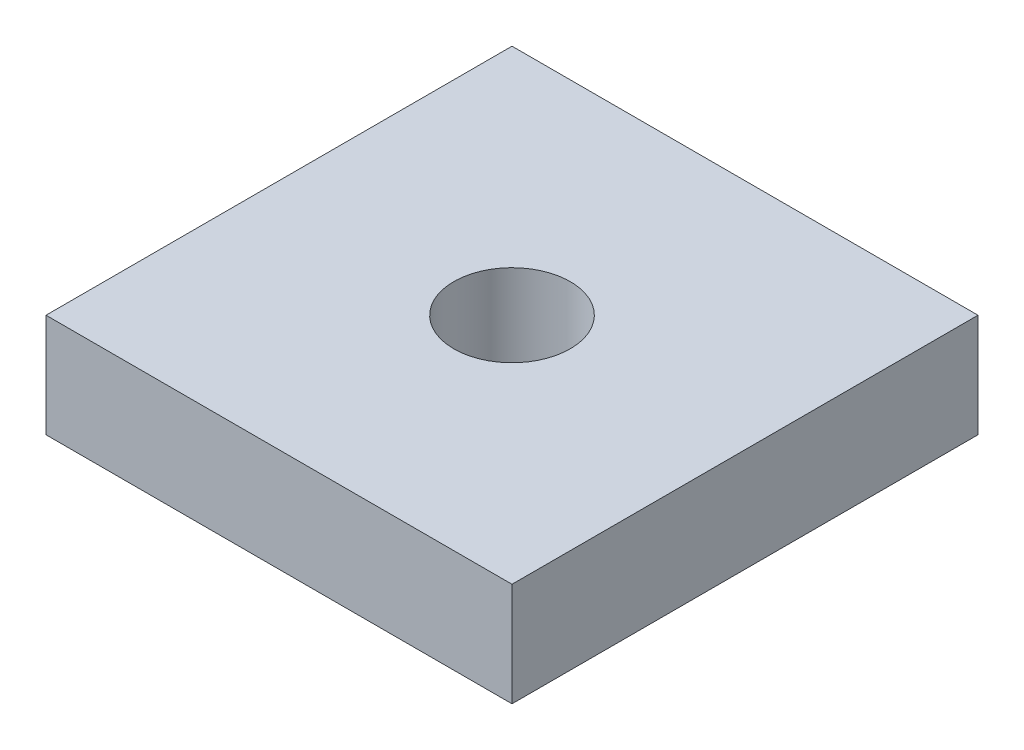
ISO-10303-21;
HEADER;
FILE_DESCRIPTION(('STEP AP214'),'2;1');
FILE_NAME('part.step','',(''),(''),'','','');
FILE_SCHEMA(('AUTOMOTIVE_DESIGN { 1 0 10303 214 1 1 1 1 }'));
ENDSEC;
DATA;
#1=APPLICATION_CONTEXT('core data for automotive mechanical design processes');
#2=APPLICATION_PROTOCOL_DEFINITION('international standard','automotive_design',2000,#1);
#3=PRODUCT_CONTEXT('',#1,'mechanical');
#4=PRODUCT('Part','Part','',(#3));
#5=PRODUCT_RELATED_PRODUCT_CATEGORY('part','',(#4));
#6=PRODUCT_DEFINITION_FORMATION('','',#4);
#7=PRODUCT_DEFINITION_CONTEXT('part definition',#1,'design');
#8=PRODUCT_DEFINITION('design','',#6,#7);
#9=PRODUCT_DEFINITION_SHAPE('','',#8);
#10=(LENGTH_UNIT() NAMED_UNIT(*) SI_UNIT(.MILLI.,.METRE.));
#11=(NAMED_UNIT(*) PLANE_ANGLE_UNIT() SI_UNIT($,.RADIAN.));
#12=(NAMED_UNIT(*) SI_UNIT($,.STERADIAN.) SOLID_ANGLE_UNIT());
#13=UNCERTAINTY_MEASURE_WITH_UNIT(LENGTH_MEASURE(1.E-05),#10,'distance_accuracy_value','');
#14=(GEOMETRIC_REPRESENTATION_CONTEXT(3) GLOBAL_UNCERTAINTY_ASSIGNED_CONTEXT((#13)) GLOBAL_UNIT_ASSIGNED_CONTEXT((#10,
#11,#12)) REPRESENTATION_CONTEXT('',''));
#15=CARTESIAN_POINT('',(0.,0.,0.));
#16=DIRECTION('',(0.,0.,1.));
#17=DIRECTION('',(1.,0.,0.));
#18=AXIS2_PLACEMENT_3D('',#15,#16,#17);
#19=CARTESIAN_POINT('',(-9.,2.,-9.));
#20=DIRECTION('',(1.,0.,0.));
#21=DIRECTION('',(0.,0.,-1.));
#22=AXIS2_PLACEMENT_3D('',#19,#20,#21);
#23=PLANE('',#22);
#24=DIRECTION('',(0.,0.,1.));
#25=VECTOR('',#24,1.);
#26=CARTESIAN_POINT('',(-9.,-2.,-9.));
#27=LINE('',#26,#25);
#28=CARTESIAN_POINT('',(-9.,-2.,-9.));
#29=VERTEX_POINT('',#28);
#30=CARTESIAN_POINT('',(-9.,-2.,9.));
#31=VERTEX_POINT('',#30);
#32=EDGE_CURVE('E79',#29,#31,#27,.T.);
#33=ORIENTED_EDGE('',*,*,#32,.T.);
#34=DIRECTION('',(0.,-1.,0.));
#35=VECTOR('',#34,1.);
#36=CARTESIAN_POINT('',(-9.,2.,9.));
#37=LINE('',#36,#35);
#38=CARTESIAN_POINT('',(-9.,2.,9.));
#39=VERTEX_POINT('',#38);
#40=EDGE_CURVE('E10',#39,#31,#37,.T.);
#41=ORIENTED_EDGE('',*,*,#40,.F.);
#42=DIRECTION('',(0.,0.,1.));
#43=VECTOR('',#42,1.);
#44=CARTESIAN_POINT('',(-9.,2.,-9.));
#45=LINE('',#44,#43);
#46=CARTESIAN_POINT('',(-9.,2.,-9.));
#47=VERTEX_POINT('',#46);
#48=EDGE_CURVE('E67',#47,#39,#45,.T.);
#49=ORIENTED_EDGE('',*,*,#48,.F.);
#50=DIRECTION('',(0.,-1.,0.));
#51=VECTOR('',#50,1.);
#52=CARTESIAN_POINT('',(-9.,2.,-9.));
#53=LINE('',#52,#51);
#54=EDGE_CURVE('E75',#47,#29,#53,.T.);
#55=ORIENTED_EDGE('',*,*,#54,.T.);
#56=EDGE_LOOP('',(#33,#41,#49,#55));
#57=FACE_BOUND('',#56,.T.);
#58=ADVANCED_FACE('F16',(#57),#23,.F.);
#59=CARTESIAN_POINT('',(-9.,2.,9.));
#60=DIRECTION('',(0.,0.,-1.));
#61=DIRECTION('',(-1.,0.,0.));
#62=AXIS2_PLACEMENT_3D('',#59,#60,#61);
#63=PLANE('',#62);
#64=DIRECTION('',(1.,0.,0.));
#65=VECTOR('',#64,1.);
#66=CARTESIAN_POINT('',(-9.,-2.,9.));
#67=LINE('',#66,#65);
#68=CARTESIAN_POINT('',(9.00000000000001,-2.,9.));
#69=VERTEX_POINT('',#68);
#70=EDGE_CURVE('E71',#31,#69,#67,.T.);
#71=ORIENTED_EDGE('',*,*,#70,.T.);
#72=DIRECTION('',(0.,-1.,0.));
#73=VECTOR('',#72,1.);
#74=CARTESIAN_POINT('',(9.00000000000001,2.,9.));
#75=LINE('',#74,#73);
#76=CARTESIAN_POINT('',(9.00000000000001,2.,9.));
#77=VERTEX_POINT('',#76);
#78=EDGE_CURVE('E24',#77,#69,#75,.T.);
#79=ORIENTED_EDGE('',*,*,#78,.F.);
#80=DIRECTION('',(1.,0.,0.));
#81=VECTOR('',#80,1.);
#82=CARTESIAN_POINT('',(-9.,2.,9.));
#83=LINE('',#82,#81);
#84=EDGE_CURVE('E62',#39,#77,#83,.T.);
#85=ORIENTED_EDGE('',*,*,#84,.F.);
#86=ORIENTED_EDGE('',*,*,#40,.T.);
#87=EDGE_LOOP('',(#71,#79,#85,#86));
#88=FACE_BOUND('',#87,.T.);
#89=ADVANCED_FACE('F70',(#88),#63,.F.);
#90=CARTESIAN_POINT('',(9.,2.,-9.));
#91=DIRECTION('',(-1.,0.,0.));
#92=DIRECTION('',(0.,0.,1.));
#93=AXIS2_PLACEMENT_3D('',#90,#91,#92);
#94=PLANE('',#93);
#95=DIRECTION('',(0.,0.,-1.));
#96=VECTOR('',#95,1.);
#97=CARTESIAN_POINT('',(9.,-2.,-9.));
#98=LINE('',#97,#96);
#99=CARTESIAN_POINT('',(9.,-2.,-9.));
#100=VERTEX_POINT('',#99);
#101=EDGE_CURVE('E49',#69,#100,#98,.T.);
#102=ORIENTED_EDGE('',*,*,#101,.T.);
#103=DIRECTION('',(0.,-1.,0.));
#104=VECTOR('',#103,1.);
#105=CARTESIAN_POINT('',(9.,2.,-9.));
#106=LINE('',#105,#104);
#107=CARTESIAN_POINT('',(9.,2.,-9.));
#108=VERTEX_POINT('',#107);
#109=EDGE_CURVE('E72',#108,#100,#106,.T.);
#110=ORIENTED_EDGE('',*,*,#109,.F.);
#111=DIRECTION('',(0.,0.,-1.));
#112=VECTOR('',#111,1.);
#113=CARTESIAN_POINT('',(9.,2.,-9.));
#114=LINE('',#113,#112);
#115=EDGE_CURVE('E65',#77,#108,#114,.T.);
#116=ORIENTED_EDGE('',*,*,#115,.F.);
#117=ORIENTED_EDGE('',*,*,#78,.T.);
#118=EDGE_LOOP('',(#102,#110,#116,#117));
#119=FACE_BOUND('',#118,.T.);
#120=ADVANCED_FACE('F73',(#119),#94,.F.);
#121=CARTESIAN_POINT('',(-9.,2.,-9.));
#122=DIRECTION('',(0.,0.,1.));
#123=DIRECTION('',(1.,0.,0.));
#124=AXIS2_PLACEMENT_3D('',#121,#122,#123);
#125=PLANE('',#124);
#126=DIRECTION('',(-1.,0.,0.));
#127=VECTOR('',#126,1.);
#128=CARTESIAN_POINT('',(-9.,-2.,-9.));
#129=LINE('',#128,#127);
#130=EDGE_CURVE('E55',#100,#29,#129,.T.);
#131=ORIENTED_EDGE('',*,*,#130,.T.);
#132=ORIENTED_EDGE('',*,*,#54,.F.);
#133=DIRECTION('',(-1.,0.,0.));
#134=VECTOR('',#133,1.);
#135=CARTESIAN_POINT('',(-9.,2.,-9.));
#136=LINE('',#135,#134);
#137=EDGE_CURVE('E32',#108,#47,#136,.T.);
#138=ORIENTED_EDGE('',*,*,#137,.F.);
#139=ORIENTED_EDGE('',*,*,#109,.T.);
#140=EDGE_LOOP('',(#131,#132,#138,#139));
#141=FACE_BOUND('',#140,.T.);
#142=ADVANCED_FACE('F87',(#141),#125,.F.);
#143=CARTESIAN_POINT('',(0.,2.,0.));
#144=DIRECTION('',(0.,1.,0.));
#145=DIRECTION('',(0.,0.,1.));
#146=AXIS2_PLACEMENT_3D('',#143,#144,#145);
#147=PLANE('',#146);
#148=CARTESIAN_POINT('',(0.,2.,0.));
#149=DIRECTION('',(0.,1.,0.));
#150=DIRECTION('',(0.,0.,1.));
#151=AXIS2_PLACEMENT_3D('',#148,#149,#150);
#152=CIRCLE('',#151,2.25);
#153=CARTESIAN_POINT('',(0.,2.,2.25));
#154=VERTEX_POINT('',#153);
#155=EDGE_CURVE('E93',#154,#154,#152,.T.);
#156=ORIENTED_EDGE('',*,*,#155,.F.);
#157=EDGE_LOOP('',(#156));
#158=FACE_BOUND('',#157,.T.);
#159=ORIENTED_EDGE('',*,*,#48,.T.);
#160=ORIENTED_EDGE('',*,*,#84,.T.);
#161=ORIENTED_EDGE('',*,*,#115,.T.);
#162=ORIENTED_EDGE('',*,*,#137,.T.);
#163=EDGE_LOOP('',(#159,#160,#161,#162));
#164=FACE_BOUND('',#163,.T.);
#165=ADVANCED_FACE('F63',(#158,#164),#147,.T.);
#166=CARTESIAN_POINT('',(0.,-2.,0.));
#167=DIRECTION('',(0.,1.,0.));
#168=DIRECTION('',(0.,0.,1.));
#169=AXIS2_PLACEMENT_3D('',#166,#167,#168);
#170=PLANE('',#169);
#171=CARTESIAN_POINT('',(0.,-2.,0.));
#172=DIRECTION('',(0.,1.,0.));
#173=DIRECTION('',(0.,0.,1.));
#174=AXIS2_PLACEMENT_3D('',#171,#172,#173);
#175=CIRCLE('',#174,2.25);
#176=CARTESIAN_POINT('',(0.,-2.,2.25));
#177=VERTEX_POINT('',#176);
#178=EDGE_CURVE('E82',#177,#177,#175,.T.);
#179=ORIENTED_EDGE('',*,*,#178,.T.);
#180=EDGE_LOOP('',(#179));
#181=FACE_BOUND('',#180,.T.);
#182=ORIENTED_EDGE('',*,*,#32,.F.);
#183=ORIENTED_EDGE('',*,*,#130,.F.);
#184=ORIENTED_EDGE('',*,*,#101,.F.);
#185=ORIENTED_EDGE('',*,*,#70,.F.);
#186=EDGE_LOOP('',(#182,#183,#184,#185));
#187=FACE_BOUND('',#186,.T.);
#188=ADVANCED_FACE('F90',(#181,#187),#170,.F.);
#189=CARTESIAN_POINT('',(0.,-2.,0.));
#190=DIRECTION('',(0.,1.,0.));
#191=DIRECTION('',(0.,0.,1.));
#192=AXIS2_PLACEMENT_3D('',#189,#190,#191);
#193=CYLINDRICAL_SURFACE('',#192,2.25);
#194=ORIENTED_EDGE('',*,*,#178,.F.);
#195=EDGE_LOOP('',(#194));
#196=FACE_BOUND('',#195,.T.);
#197=ORIENTED_EDGE('',*,*,#155,.T.);
#198=EDGE_LOOP('',(#197));
#199=FACE_BOUND('',#198,.T.);
#200=ADVANCED_FACE('F100',(#196,#199),#193,.F.);
#201=CLOSED_SHELL('',(#58,#89,#120,#142,#165,#188,#200));
#202=MANIFOLD_SOLID_BREP('B1',#201);
#203=ADVANCED_BREP_SHAPE_REPRESENTATION('',(#18,#202),#14);
#204=SHAPE_DEFINITION_REPRESENTATION(#9,#203);
ENDSEC;
END-ISO-10303-21;
